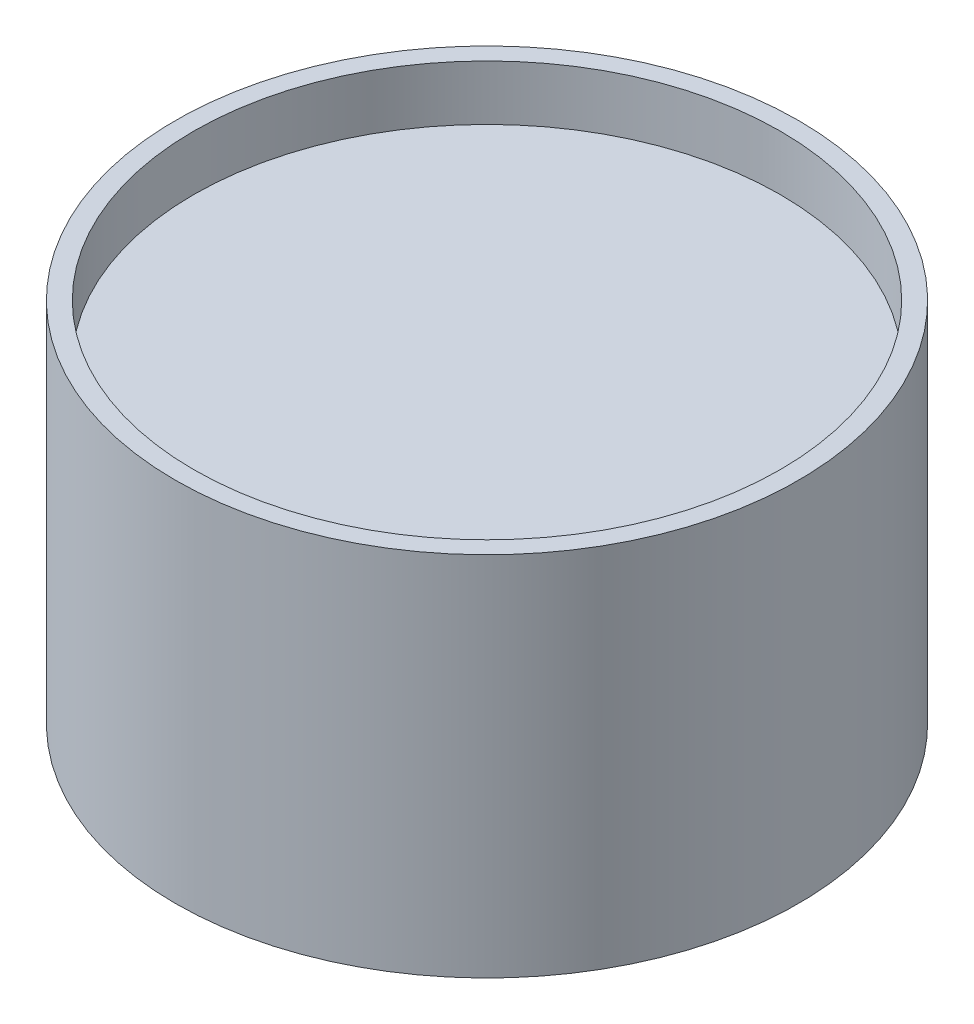
ISO-10303-21;
HEADER;
FILE_DESCRIPTION(('STEP AP214'),'2;1');
FILE_NAME('part.step','',(''),(''),'','','');
FILE_SCHEMA(('AUTOMOTIVE_DESIGN { 1 0 10303 214 1 1 1 1 }'));
ENDSEC;
DATA;
#1=APPLICATION_CONTEXT('core data for automotive mechanical design processes');
#2=APPLICATION_PROTOCOL_DEFINITION('international standard','automotive_design',2000,#1);
#3=PRODUCT_CONTEXT('',#1,'mechanical');
#4=PRODUCT('Part','Part','',(#3));
#5=PRODUCT_RELATED_PRODUCT_CATEGORY('part','',(#4));
#6=PRODUCT_DEFINITION_FORMATION('','',#4);
#7=PRODUCT_DEFINITION_CONTEXT('part definition',#1,'design');
#8=PRODUCT_DEFINITION('design','',#6,#7);
#9=PRODUCT_DEFINITION_SHAPE('','',#8);
#10=(LENGTH_UNIT() NAMED_UNIT(*) SI_UNIT(.MILLI.,.METRE.));
#11=(NAMED_UNIT(*) PLANE_ANGLE_UNIT() SI_UNIT($,.RADIAN.));
#12=(NAMED_UNIT(*) SI_UNIT($,.STERADIAN.) SOLID_ANGLE_UNIT());
#13=UNCERTAINTY_MEASURE_WITH_UNIT(LENGTH_MEASURE(1.E-05),#10,'distance_accuracy_value','');
#14=(GEOMETRIC_REPRESENTATION_CONTEXT(3) GLOBAL_UNCERTAINTY_ASSIGNED_CONTEXT((#13)) GLOBAL_UNIT_ASSIGNED_CONTEXT((#10,
#11,#12)) REPRESENTATION_CONTEXT('',''));
#15=CARTESIAN_POINT('',(0.,0.,0.));
#16=DIRECTION('',(0.,0.,1.));
#17=DIRECTION('',(1.,0.,0.));
#18=AXIS2_PLACEMENT_3D('',#15,#16,#17);
#19=CARTESIAN_POINT('',(0.,20.,0.));
#20=DIRECTION('',(0.,-1.,0.));
#21=DIRECTION('',(0.,0.,-1.));
#22=AXIS2_PLACEMENT_3D('',#19,#20,#21);
#23=CYLINDRICAL_SURFACE('',#22,17.);
#24=CARTESIAN_POINT('',(0.,20.,0.));
#25=DIRECTION('',(0.,1.,0.));
#26=DIRECTION('',(0.,0.,1.));
#27=AXIS2_PLACEMENT_3D('',#24,#25,#26);
#28=CIRCLE('',#27,17.);
#29=CARTESIAN_POINT('',(0.,20.,17.));
#30=VERTEX_POINT('',#29);
#31=EDGE_CURVE('E38',#30,#30,#28,.T.);
#32=ORIENTED_EDGE('',*,*,#31,.F.);
#33=EDGE_LOOP('',(#32));
#34=FACE_BOUND('',#33,.T.);
#35=CARTESIAN_POINT('',(0.,0.,0.));
#36=DIRECTION('',(0.,1.,0.));
#37=DIRECTION('',(0.,0.,1.));
#38=AXIS2_PLACEMENT_3D('',#35,#36,#37);
#39=CIRCLE('',#38,17.);
#40=CARTESIAN_POINT('',(0.,0.,17.));
#41=VERTEX_POINT('',#40);
#42=EDGE_CURVE('E42',#41,#41,#39,.T.);
#43=ORIENTED_EDGE('',*,*,#42,.T.);
#44=EDGE_LOOP('',(#43));
#45=FACE_BOUND('',#44,.T.);
#46=ADVANCED_FACE('F31',(#34,#45),#23,.T.);
#47=CARTESIAN_POINT('',(0.,20.,0.));
#48=DIRECTION('',(0.,1.,0.));
#49=DIRECTION('',(0.,0.,1.));
#50=AXIS2_PLACEMENT_3D('',#47,#48,#49);
#51=PLANE('',#50);
#52=CARTESIAN_POINT('',(0.,20.,0.));
#53=DIRECTION('',(0.,1.,0.));
#54=DIRECTION('',(0.,0.,1.));
#55=AXIS2_PLACEMENT_3D('',#52,#53,#54);
#56=CIRCLE('',#55,16.);
#57=CARTESIAN_POINT('',(0.,20.,16.));
#58=VERTEX_POINT('',#57);
#59=EDGE_CURVE('E49',#58,#58,#56,.T.);
#60=ORIENTED_EDGE('',*,*,#59,.F.);
#61=EDGE_LOOP('',(#60));
#62=FACE_BOUND('',#61,.T.);
#63=ORIENTED_EDGE('',*,*,#31,.T.);
#64=EDGE_LOOP('',(#63));
#65=FACE_BOUND('',#64,.T.);
#66=ADVANCED_FACE('F64',(#62,#65),#51,.T.);
#67=CARTESIAN_POINT('',(0.,0.,0.));
#68=DIRECTION('',(0.,1.,0.));
#69=DIRECTION('',(0.,0.,1.));
#70=AXIS2_PLACEMENT_3D('',#67,#68,#69);
#71=PLANE('',#70);
#72=CARTESIAN_POINT('',(0.,0.,0.));
#73=DIRECTION('',(0.,-1.,0.));
#74=DIRECTION('',(0.,0.,-1.));
#75=AXIS2_PLACEMENT_3D('',#72,#73,#74);
#76=CIRCLE('',#75,1.);
#77=CARTESIAN_POINT('',(0.,0.,-1.));
#78=VERTEX_POINT('',#77);
#79=EDGE_CURVE('E52',#78,#78,#76,.T.);
#80=ORIENTED_EDGE('',*,*,#79,.F.);
#81=EDGE_LOOP('',(#80));
#82=FACE_BOUND('',#81,.T.);
#83=ORIENTED_EDGE('',*,*,#42,.F.);
#84=EDGE_LOOP('',(#83));
#85=FACE_BOUND('',#84,.T.);
#86=ADVANCED_FACE('F60',(#82,#85),#71,.F.);
#87=CARTESIAN_POINT('',(0.,17.,0.));
#88=DIRECTION('',(0.,1.,0.));
#89=DIRECTION('',(0.,0.,1.));
#90=AXIS2_PLACEMENT_3D('',#87,#88,#89);
#91=CYLINDRICAL_SURFACE('',#90,16.);
#92=CARTESIAN_POINT('',(0.,17.,0.));
#93=DIRECTION('',(0.,1.,0.));
#94=DIRECTION('',(0.,0.,1.));
#95=AXIS2_PLACEMENT_3D('',#92,#93,#94);
#96=CIRCLE('',#95,16.);
#97=CARTESIAN_POINT('',(0.,17.,16.));
#98=VERTEX_POINT('',#97);
#99=EDGE_CURVE('E47',#98,#98,#96,.T.);
#100=ORIENTED_EDGE('',*,*,#99,.F.);
#101=EDGE_LOOP('',(#100));
#102=FACE_BOUND('',#101,.T.);
#103=ORIENTED_EDGE('',*,*,#59,.T.);
#104=EDGE_LOOP('',(#103));
#105=FACE_BOUND('',#104,.T.);
#106=ADVANCED_FACE('F63',(#102,#105),#91,.F.);
#107=CARTESIAN_POINT('',(0.,17.,0.));
#108=DIRECTION('',(0.,1.,0.));
#109=DIRECTION('',(0.,0.,1.));
#110=AXIS2_PLACEMENT_3D('',#107,#108,#109);
#111=PLANE('',#110);
#112=ORIENTED_EDGE('',*,*,#99,.T.);
#113=EDGE_LOOP('',(#112));
#114=FACE_BOUND('',#113,.T.);
#115=ADVANCED_FACE('F78',(#114),#111,.T.);
#116=CARTESIAN_POINT('',(0.,2.,0.));
#117=DIRECTION('',(0.,-1.,0.));
#118=DIRECTION('',(0.,0.,-1.));
#119=AXIS2_PLACEMENT_3D('',#116,#117,#118);
#120=CYLINDRICAL_SURFACE('',#119,1.);
#121=CARTESIAN_POINT('',(0.,1.,0.));
#122=DIRECTION('',(0.,-1.,0.));
#123=DIRECTION('',(0.,0.,-1.));
#124=AXIS2_PLACEMENT_3D('',#121,#122,#123);
#125=CIRCLE('',#124,1.);
#126=CARTESIAN_POINT('',(0.,1.,-1.));
#127=VERTEX_POINT('',#126);
#128=EDGE_CURVE('E10',#127,#127,#125,.F.);
#129=ORIENTED_EDGE('',*,*,#128,.T.);
#130=EDGE_LOOP('',(#129));
#131=FACE_BOUND('',#130,.T.);
#132=ORIENTED_EDGE('',*,*,#79,.T.);
#133=EDGE_LOOP('',(#132));
#134=FACE_BOUND('',#133,.T.);
#135=ADVANCED_FACE('F58',(#131,#134),#120,.F.);
#136=CARTESIAN_POINT('',(0.,1.,0.));
#137=DIRECTION('',(0.,-1.,0.));
#138=DIRECTION('',(0.,0.,-1.));
#139=AXIS2_PLACEMENT_3D('',#136,#137,#138);
#140=SPHERICAL_SURFACE('',#139,1.);
#141=ORIENTED_EDGE('',*,*,#128,.F.);
#142=EDGE_LOOP('',(#141));
#143=FACE_BOUND('',#142,.T.);
#144=ADVANCED_FACE('F33',(#143),#140,.F.);
#145=CLOSED_SHELL('',(#46,#66,#86,#106,#115,#135,#144));
#146=MANIFOLD_SOLID_BREP('B2',#145);
#147=ADVANCED_BREP_SHAPE_REPRESENTATION('',(#18,#146),#14);
#148=SHAPE_DEFINITION_REPRESENTATION(#9,#147);
ENDSEC;
END-ISO-10303-21;
